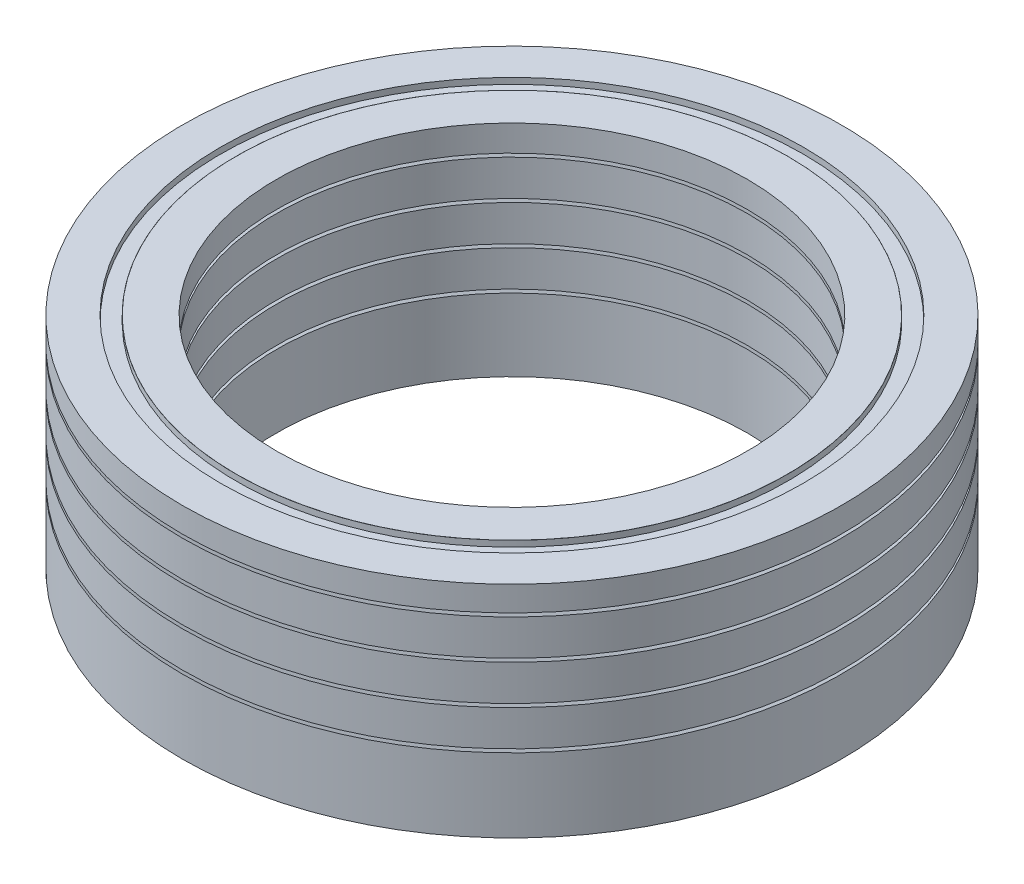
ISO-10303-21;
HEADER;
FILE_DESCRIPTION(('STEP AP214'),'2;1');
FILE_NAME('part.step','',(''),(''),'','','');
FILE_SCHEMA(('AUTOMOTIVE_DESIGN { 1 0 10303 214 1 1 1 1 }'));
ENDSEC;
DATA;
#1=APPLICATION_CONTEXT('core data for automotive mechanical design processes');
#2=APPLICATION_PROTOCOL_DEFINITION('international standard','automotive_design',2000,#1);
#3=PRODUCT_CONTEXT('',#1,'mechanical');
#4=PRODUCT('Part','Part','',(#3));
#5=PRODUCT_RELATED_PRODUCT_CATEGORY('part','',(#4));
#6=PRODUCT_DEFINITION_FORMATION('','',#4);
#7=PRODUCT_DEFINITION_CONTEXT('part definition',#1,'design');
#8=PRODUCT_DEFINITION('design','',#6,#7);
#9=PRODUCT_DEFINITION_SHAPE('','',#8);
#10=(LENGTH_UNIT() NAMED_UNIT(*) SI_UNIT(.MILLI.,.METRE.));
#11=(NAMED_UNIT(*) PLANE_ANGLE_UNIT() SI_UNIT($,.RADIAN.));
#12=(NAMED_UNIT(*) SI_UNIT($,.STERADIAN.) SOLID_ANGLE_UNIT());
#13=UNCERTAINTY_MEASURE_WITH_UNIT(LENGTH_MEASURE(1.E-05),#10,'distance_accuracy_value','');
#14=(GEOMETRIC_REPRESENTATION_CONTEXT(3) GLOBAL_UNCERTAINTY_ASSIGNED_CONTEXT((#13)) GLOBAL_UNIT_ASSIGNED_CONTEXT((#10,
#11,#12)) REPRESENTATION_CONTEXT('',''));
#15=CARTESIAN_POINT('',(0.,0.,0.));
#16=DIRECTION('',(0.,0.,1.));
#17=DIRECTION('',(1.,0.,0.));
#18=AXIS2_PLACEMENT_3D('',#15,#16,#17);
#19=CARTESIAN_POINT('',(0.,14.,0.));
#20=DIRECTION('',(0.,-1.,0.));
#21=DIRECTION('',(0.,0.,-1.));
#22=AXIS2_PLACEMENT_3D('',#19,#20,#21);
#23=CYLINDRICAL_SURFACE('',#22,21.);
#24=CARTESIAN_POINT('',(0.,0.,0.));
#25=DIRECTION('',(0.,1.,0.));
#26=DIRECTION('',(0.,0.,1.));
#27=AXIS2_PLACEMENT_3D('',#24,#25,#26);
#28=CIRCLE('',#27,21.);
#29=CARTESIAN_POINT('',(0.,0.,21.));
#30=VERTEX_POINT('',#29);
#31=EDGE_CURVE('E66',#30,#30,#28,.T.);
#32=ORIENTED_EDGE('',*,*,#31,.T.);
#33=EDGE_LOOP('',(#32));
#34=FACE_BOUND('',#33,.T.);
#35=CARTESIAN_POINT('',(0.,4.69528194298986,0.));
#36=DIRECTION('',(0.,1.,0.));
#37=DIRECTION('',(0.,0.,1.));
#38=AXIS2_PLACEMENT_3D('',#35,#36,#37);
#39=CIRCLE('',#38,21.);
#40=CARTESIAN_POINT('',(0.,4.69528194298986,21.));
#41=VERTEX_POINT('',#40);
#42=EDGE_CURVE('E51',#41,#41,#39,.T.);
#43=ORIENTED_EDGE('',*,*,#42,.F.);
#44=EDGE_LOOP('',(#43));
#45=FACE_BOUND('',#44,.T.);
#46=ADVANCED_FACE('F39',(#34,#45),#23,.T.);
#47=CARTESIAN_POINT('',(0.,14.,0.));
#48=DIRECTION('',(0.,-1.,0.));
#49=DIRECTION('',(0.,0.,-1.));
#50=AXIS2_PLACEMENT_3D('',#47,#48,#49);
#51=CYLINDRICAL_SURFACE('',#50,15.);
#52=CARTESIAN_POINT('',(0.,0.,0.));
#53=DIRECTION('',(0.,1.,0.));
#54=DIRECTION('',(0.,0.,1.));
#55=AXIS2_PLACEMENT_3D('',#52,#53,#54);
#56=CIRCLE('',#55,15.);
#57=CARTESIAN_POINT('',(0.,0.,15.));
#58=VERTEX_POINT('',#57);
#59=EDGE_CURVE('E54',#58,#58,#56,.T.);
#60=ORIENTED_EDGE('',*,*,#59,.F.);
#61=EDGE_LOOP('',(#60));
#62=FACE_BOUND('',#61,.T.);
#63=CARTESIAN_POINT('',(0.,4.61704368073582,0.));
#64=DIRECTION('',(0.,-1.,0.));
#65=DIRECTION('',(0.,0.,-1.));
#66=AXIS2_PLACEMENT_3D('',#63,#64,#65);
#67=CIRCLE('',#66,15.);
#68=CARTESIAN_POINT('',(0.,4.61704368073582,-15.));
#69=VERTEX_POINT('',#68);
#70=EDGE_CURVE('E62',#69,#69,#67,.F.);
#71=ORIENTED_EDGE('',*,*,#70,.T.);
#72=EDGE_LOOP('',(#71));
#73=FACE_BOUND('',#72,.T.);
#74=ADVANCED_FACE('F78',(#62,#73),#51,.F.);
#75=CARTESIAN_POINT('',(0.,0.,0.));
#76=DIRECTION('',(0.,1.,0.));
#77=DIRECTION('',(0.,0.,1.));
#78=AXIS2_PLACEMENT_3D('',#75,#76,#77);
#79=PLANE('',#78);
#80=ORIENTED_EDGE('',*,*,#31,.F.);
#81=EDGE_LOOP('',(#80));
#82=FACE_BOUND('',#81,.T.);
#83=ORIENTED_EDGE('',*,*,#59,.T.);
#84=EDGE_LOOP('',(#83));
#85=FACE_BOUND('',#84,.T.);
#86=ADVANCED_FACE('F83',(#82,#85),#79,.F.);
#87=CARTESIAN_POINT('',(0.,0.,0.));
#88=DIRECTION('',(0.,-1.,0.));
#89=DIRECTION('',(0.,0.,-1.));
#90=AXIS2_PLACEMENT_3D('',#87,#88,#89);
#91=CYLINDRICAL_SURFACE('',#90,18.5603987615445);
#92=CARTESIAN_POINT('',(0.,3.11396489088046,0.));
#93=DIRECTION('',(0.,-1.,0.));
#94=DIRECTION('',(0.,0.,-1.));
#95=AXIS2_PLACEMENT_3D('',#92,#93,#94);
#96=CIRCLE('',#95,18.5603987615445);
#97=CARTESIAN_POINT('',(0.,3.11396489088046,-18.5603987615445));
#98=VERTEX_POINT('',#97);
#99=EDGE_CURVE('E56',#98,#98,#96,.T.);
#100=ORIENTED_EDGE('',*,*,#99,.T.);
#101=EDGE_LOOP('',(#100));
#102=FACE_BOUND('',#101,.T.);
#103=CARTESIAN_POINT('',(0.,3.52070715703717,0.));
#104=DIRECTION('',(0.,-1.,0.));
#105=DIRECTION('',(0.,0.,-1.));
#106=AXIS2_PLACEMENT_3D('',#103,#104,#105);
#107=CIRCLE('',#106,18.5603987615445);
#108=CARTESIAN_POINT('',(0.,3.52070715703717,-18.5603987615445));
#109=VERTEX_POINT('',#108);
#110=EDGE_CURVE('E42',#109,#109,#107,.T.);
#111=ORIENTED_EDGE('',*,*,#110,.F.);
#112=EDGE_LOOP('',(#111));
#113=FACE_BOUND('',#112,.T.);
#114=ADVANCED_FACE('F88',(#102,#113),#91,.F.);
#115=CARTESIAN_POINT('',(0.,4.83961079064219,0.));
#116=DIRECTION('',(0.,1.,0.));
#117=DIRECTION('',(0.,0.,1.));
#118=AXIS2_PLACEMENT_3D('',#115,#116,#117);
#119=CONICAL_SURFACE('',#118,21.2997721726096,1.12208896626812);
#120=ORIENTED_EDGE('',*,*,#110,.T.);
#121=EDGE_LOOP('',(#120));
#122=FACE_BOUND('',#121,.T.);
#123=ORIENTED_EDGE('',*,*,#42,.T.);
#124=EDGE_LOOP('',(#123));
#125=FACE_BOUND('',#124,.T.);
#126=ADVANCED_FACE('F75',(#122,#125),#119,.F.);
#127=CARTESIAN_POINT('',(0.,3.11396489088046,18.5603987615445));
#128=DIRECTION('',(0.,1.,0.));
#129=DIRECTION('',(0.,0.,1.));
#130=AXIS2_PLACEMENT_3D('',#127,#128,#129);
#131=PLANE('',#130);
#132=CARTESIAN_POINT('',(0.,3.11396489088046,0.));
#133=DIRECTION('',(0.,-1.,0.));
#134=DIRECTION('',(0.,0.,-1.));
#135=AXIS2_PLACEMENT_3D('',#132,#133,#134);
#136=CIRCLE('',#135,17.5603987615445);
#137=CARTESIAN_POINT('',(0.,3.11396489088046,-17.5603987615445));
#138=VERTEX_POINT('',#137);
#139=EDGE_CURVE('E46',#138,#138,#136,.T.);
#140=ORIENTED_EDGE('',*,*,#139,.T.);
#141=EDGE_LOOP('',(#140));
#142=FACE_BOUND('',#141,.T.);
#143=ORIENTED_EDGE('',*,*,#99,.F.);
#144=EDGE_LOOP('',(#143));
#145=FACE_BOUND('',#144,.T.);
#146=ADVANCED_FACE('F102',(#142,#145),#131,.T.);
#147=CARTESIAN_POINT('',(0.,0.,0.));
#148=DIRECTION('',(0.,-1.,0.));
#149=DIRECTION('',(0.,0.,-1.));
#150=AXIS2_PLACEMENT_3D('',#147,#148,#149);
#151=CYLINDRICAL_SURFACE('',#150,17.5603987615445);
#152=CARTESIAN_POINT('',(0.,3.49842286258532,0.));
#153=DIRECTION('',(0.,-1.,0.));
#154=DIRECTION('',(0.,0.,-1.));
#155=AXIS2_PLACEMENT_3D('',#152,#153,#154);
#156=CIRCLE('',#155,17.5603987615445);
#157=CARTESIAN_POINT('',(0.,3.49842286258532,-17.5603987615445));
#158=VERTEX_POINT('',#157);
#159=EDGE_CURVE('E11',#158,#158,#156,.T.);
#160=ORIENTED_EDGE('',*,*,#159,.T.);
#161=EDGE_LOOP('',(#160));
#162=FACE_BOUND('',#161,.T.);
#163=ORIENTED_EDGE('',*,*,#139,.F.);
#164=EDGE_LOOP('',(#163));
#165=FACE_BOUND('',#164,.T.);
#166=ADVANCED_FACE('F98',(#162,#165),#151,.T.);
#167=CARTESIAN_POINT('',(0.,3.49842286258532,0.));
#168=DIRECTION('',(0.,-1.,0.));
#169=DIRECTION('',(0.,0.,-1.));
#170=AXIS2_PLACEMENT_3D('',#167,#168,#169);
#171=CONICAL_SURFACE('',#170,17.5603987615445,1.15889530950393);
#172=ORIENTED_EDGE('',*,*,#70,.F.);
#173=EDGE_LOOP('',(#172));
#174=FACE_BOUND('',#173,.T.);
#175=ORIENTED_EDGE('',*,*,#159,.F.);
#176=EDGE_LOOP('',(#175));
#177=FACE_BOUND('',#176,.T.);
#178=ADVANCED_FACE('F95',(#174,#177),#171,.T.);
#179=CLOSED_SHELL('',(#46,#74,#86,#114,#126,#146,#166,#178));
#180=MANIFOLD_SOLID_BREP('B2',#179);
#181=CARTESIAN_POINT('',(0.,14.,0.));
#182=DIRECTION('',(0.,-1.,0.));
#183=DIRECTION('',(0.,0.,-1.));
#184=AXIS2_PLACEMENT_3D('',#181,#182,#183);
#185=CYLINDRICAL_SURFACE('',#184,15.);
#186=CARTESIAN_POINT('',(0.,4.83529818095055,0.));
#187=DIRECTION('',(0.,-1.,0.));
#188=DIRECTION('',(0.,0.,-1.));
#189=AXIS2_PLACEMENT_3D('',#186,#187,#188);
#190=CIRCLE('',#189,15.);
#191=CARTESIAN_POINT('',(0.,4.83529818095055,-15.));
#192=VERTEX_POINT('',#191);
#193=EDGE_CURVE('E184',#192,#192,#190,.T.);
#194=ORIENTED_EDGE('',*,*,#193,.T.);
#195=EDGE_LOOP('',(#194));
#196=FACE_BOUND('',#195,.T.);
#197=CARTESIAN_POINT('',(0.,7.11704368073584,0.));
#198=DIRECTION('',(0.,-1.,0.));
#199=DIRECTION('',(0.,0.,-1.));
#200=AXIS2_PLACEMENT_3D('',#197,#198,#199);
#201=CIRCLE('',#200,15.);
#202=CARTESIAN_POINT('',(0.,7.11704368073584,-15.));
#203=VERTEX_POINT('',#202);
#204=EDGE_CURVE('E200',#203,#203,#201,.F.);
#205=ORIENTED_EDGE('',*,*,#204,.T.);
#206=EDGE_LOOP('',(#205));
#207=FACE_BOUND('',#206,.T.);
#208=ADVANCED_FACE('F168',(#196,#207),#185,.F.);
#209=CARTESIAN_POINT('',(0.,5.17758150863495,0.));
#210=DIRECTION('',(0.,-1.,0.));
#211=DIRECTION('',(0.,0.,-1.));
#212=AXIS2_PLACEMENT_3D('',#209,#210,#211);
#213=CONICAL_SURFACE('',#212,14.2165514944112,1.15889530950393);
#214=ORIENTED_EDGE('',*,*,#193,.F.);
#215=EDGE_LOOP('',(#214));
#216=FACE_BOUND('',#215,.T.);
#217=CARTESIAN_POINT('',(0.,3.5,0.));
#218=DIRECTION('',(0.,-1.,0.));
#219=DIRECTION('',(0.,0.,-1.));
#220=AXIS2_PLACEMENT_3D('',#217,#218,#219);
#221=CIRCLE('',#220,18.0563491697313);
#222=CARTESIAN_POINT('',(0.,3.5,-18.0563491697313));
#223=VERTEX_POINT('',#222);
#224=EDGE_CURVE('E172',#223,#223,#221,.T.);
#225=ORIENTED_EDGE('',*,*,#224,.T.);
#226=EDGE_LOOP('',(#225));
#227=FACE_BOUND('',#226,.T.);
#228=ADVANCED_FACE('F209',(#216,#227),#213,.F.);
#229=CARTESIAN_POINT('',(0.,3.5,0.));
#230=DIRECTION('',(0.,1.,0.));
#231=DIRECTION('',(0.,0.,1.));
#232=AXIS2_PLACEMENT_3D('',#229,#230,#231);
#233=CONICAL_SURFACE('',#232,18.0563491697313,1.12208896626812);
#234=ORIENTED_EDGE('',*,*,#224,.F.);
#235=EDGE_LOOP('',(#234));
#236=FACE_BOUND('',#235,.T.);
#237=CARTESIAN_POINT('',(0.,4.91725540608073,0.));
#238=DIRECTION('',(0.,1.,0.));
#239=DIRECTION('',(0.,0.,1.));
#240=AXIS2_PLACEMENT_3D('',#237,#238,#239);
#241=CIRCLE('',#240,21.);
#242=CARTESIAN_POINT('',(0.,4.91725540608073,21.));
#243=VERTEX_POINT('',#242);
#244=EDGE_CURVE('E190',#243,#243,#241,.F.);
#245=ORIENTED_EDGE('',*,*,#244,.T.);
#246=EDGE_LOOP('',(#245));
#247=FACE_BOUND('',#246,.T.);
#248=ADVANCED_FACE('F212',(#236,#247),#233,.T.);
#249=CARTESIAN_POINT('',(0.,0.,0.));
#250=DIRECTION('',(0.,-1.,0.));
#251=DIRECTION('',(0.,0.,-1.));
#252=AXIS2_PLACEMENT_3D('',#249,#250,#251);
#253=CYLINDRICAL_SURFACE('',#252,18.5603987615445);
#254=CARTESIAN_POINT('',(0.,5.61396489088047,0.));
#255=DIRECTION('',(0.,-1.,0.));
#256=DIRECTION('',(0.,0.,-1.));
#257=AXIS2_PLACEMENT_3D('',#254,#255,#256);
#258=CIRCLE('',#257,18.5603987615445);
#259=CARTESIAN_POINT('',(0.,5.61396489088047,-18.5603987615445));
#260=VERTEX_POINT('',#259);
#261=EDGE_CURVE('E187',#260,#260,#258,.T.);
#262=ORIENTED_EDGE('',*,*,#261,.T.);
#263=EDGE_LOOP('',(#262));
#264=FACE_BOUND('',#263,.T.);
#265=CARTESIAN_POINT('',(0.,6.02070715703719,0.));
#266=DIRECTION('',(0.,-1.,0.));
#267=DIRECTION('',(0.,0.,-1.));
#268=AXIS2_PLACEMENT_3D('',#265,#266,#267);
#269=CIRCLE('',#268,18.5603987615445);
#270=CARTESIAN_POINT('',(0.,6.02070715703719,-18.5603987615445));
#271=VERTEX_POINT('',#270);
#272=EDGE_CURVE('E189',#271,#271,#269,.T.);
#273=ORIENTED_EDGE('',*,*,#272,.F.);
#274=EDGE_LOOP('',(#273));
#275=FACE_BOUND('',#274,.T.);
#276=ADVANCED_FACE('F218',(#264,#275),#253,.F.);
#277=CARTESIAN_POINT('',(0.,7.33961079064219,0.));
#278=DIRECTION('',(0.,1.,0.));
#279=DIRECTION('',(0.,0.,1.));
#280=AXIS2_PLACEMENT_3D('',#277,#278,#279);
#281=CONICAL_SURFACE('',#280,21.2997721726096,1.12208896626812);
#282=ORIENTED_EDGE('',*,*,#272,.T.);
#283=EDGE_LOOP('',(#282));
#284=FACE_BOUND('',#283,.T.);
#285=CARTESIAN_POINT('',(0.,7.19528194298986,0.));
#286=DIRECTION('',(0.,1.,0.));
#287=DIRECTION('',(0.,0.,1.));
#288=AXIS2_PLACEMENT_3D('',#285,#286,#287);
#289=CIRCLE('',#288,21.);
#290=CARTESIAN_POINT('',(0.,7.19528194298986,21.));
#291=VERTEX_POINT('',#290);
#292=EDGE_CURVE('E181',#291,#291,#289,.T.);
#293=ORIENTED_EDGE('',*,*,#292,.T.);
#294=EDGE_LOOP('',(#293));
#295=FACE_BOUND('',#294,.T.);
#296=ADVANCED_FACE('F235',(#284,#295),#281,.F.);
#297=CARTESIAN_POINT('',(0.,5.61396489088047,18.5603987615445));
#298=DIRECTION('',(0.,1.,0.));
#299=DIRECTION('',(0.,0.,1.));
#300=AXIS2_PLACEMENT_3D('',#297,#298,#299);
#301=PLANE('',#300);
#302=CARTESIAN_POINT('',(0.,5.61396489088047,0.));
#303=DIRECTION('',(0.,-1.,0.));
#304=DIRECTION('',(0.,0.,-1.));
#305=AXIS2_PLACEMENT_3D('',#302,#303,#304);
#306=CIRCLE('',#305,17.5603987615445);
#307=CARTESIAN_POINT('',(0.,5.61396489088047,-17.5603987615445));
#308=VERTEX_POINT('',#307);
#309=EDGE_CURVE('E176',#308,#308,#306,.T.);
#310=ORIENTED_EDGE('',*,*,#309,.T.);
#311=EDGE_LOOP('',(#310));
#312=FACE_BOUND('',#311,.T.);
#313=ORIENTED_EDGE('',*,*,#261,.F.);
#314=EDGE_LOOP('',(#313));
#315=FACE_BOUND('',#314,.T.);
#316=ADVANCED_FACE('F238',(#312,#315),#301,.T.);
#317=CARTESIAN_POINT('',(0.,0.,0.));
#318=DIRECTION('',(0.,-1.,0.));
#319=DIRECTION('',(0.,0.,-1.));
#320=AXIS2_PLACEMENT_3D('',#317,#318,#319);
#321=CYLINDRICAL_SURFACE('',#320,17.5603987615445);
#322=CARTESIAN_POINT('',(0.,5.99842286258533,0.));
#323=DIRECTION('',(0.,-1.,0.));
#324=DIRECTION('',(0.,0.,-1.));
#325=AXIS2_PLACEMENT_3D('',#322,#323,#324);
#326=CIRCLE('',#325,17.5603987615445);
#327=CARTESIAN_POINT('',(0.,5.99842286258533,-17.5603987615445));
#328=VERTEX_POINT('',#327);
#329=EDGE_CURVE('E38',#328,#328,#326,.T.);
#330=ORIENTED_EDGE('',*,*,#329,.T.);
#331=EDGE_LOOP('',(#330));
#332=FACE_BOUND('',#331,.T.);
#333=ORIENTED_EDGE('',*,*,#309,.F.);
#334=EDGE_LOOP('',(#333));
#335=FACE_BOUND('',#334,.T.);
#336=ADVANCED_FACE('F228',(#332,#335),#321,.T.);
#337=CARTESIAN_POINT('',(0.,5.99842286258533,0.));
#338=DIRECTION('',(0.,-1.,0.));
#339=DIRECTION('',(0.,0.,-1.));
#340=AXIS2_PLACEMENT_3D('',#337,#338,#339);
#341=CONICAL_SURFACE('',#340,17.5603987615445,1.15889530950393);
#342=ORIENTED_EDGE('',*,*,#204,.F.);
#343=EDGE_LOOP('',(#342));
#344=FACE_BOUND('',#343,.T.);
#345=ORIENTED_EDGE('',*,*,#329,.F.);
#346=EDGE_LOOP('',(#345));
#347=FACE_BOUND('',#346,.T.);
#348=ADVANCED_FACE('F224',(#344,#347),#341,.T.);
#349=CARTESIAN_POINT('',(0.,14.,0.));
#350=DIRECTION('',(0.,-1.,0.));
#351=DIRECTION('',(0.,0.,-1.));
#352=AXIS2_PLACEMENT_3D('',#349,#350,#351);
#353=CYLINDRICAL_SURFACE('',#352,21.);
#354=ORIENTED_EDGE('',*,*,#244,.F.);
#355=EDGE_LOOP('',(#354));
#356=FACE_BOUND('',#355,.T.);
#357=ORIENTED_EDGE('',*,*,#292,.F.);
#358=EDGE_LOOP('',(#357));
#359=FACE_BOUND('',#358,.T.);
#360=ADVANCED_FACE('F170',(#356,#359),#353,.T.);
#361=CLOSED_SHELL('',(#208,#228,#248,#276,#296,#316,#336,#348,#360));
#362=MANIFOLD_SOLID_BREP('B6',#361);
#363=CARTESIAN_POINT('',(0.,14.,0.));
#364=DIRECTION('',(0.,-1.,0.));
#365=DIRECTION('',(0.,0.,-1.));
#366=AXIS2_PLACEMENT_3D('',#363,#364,#365);
#367=CYLINDRICAL_SURFACE('',#366,15.);
#368=CARTESIAN_POINT('',(0.,7.33529818095057,0.));
#369=DIRECTION('',(0.,-1.,0.));
#370=DIRECTION('',(0.,0.,-1.));
#371=AXIS2_PLACEMENT_3D('',#368,#369,#370);
#372=CIRCLE('',#371,15.);
#373=CARTESIAN_POINT('',(0.,7.33529818095057,-15.));
#374=VERTEX_POINT('',#373);
#375=EDGE_CURVE('E328',#374,#374,#372,.T.);
#376=ORIENTED_EDGE('',*,*,#375,.T.);
#377=EDGE_LOOP('',(#376));
#378=FACE_BOUND('',#377,.T.);
#379=CARTESIAN_POINT('',(0.,9.61704368073585,0.));
#380=DIRECTION('',(0.,-1.,0.));
#381=DIRECTION('',(0.,0.,-1.));
#382=AXIS2_PLACEMENT_3D('',#379,#380,#381);
#383=CIRCLE('',#382,15.);
#384=CARTESIAN_POINT('',(0.,9.61704368073585,-15.));
#385=VERTEX_POINT('',#384);
#386=EDGE_CURVE('E344',#385,#385,#383,.F.);
#387=ORIENTED_EDGE('',*,*,#386,.T.);
#388=EDGE_LOOP('',(#387));
#389=FACE_BOUND('',#388,.T.);
#390=ADVANCED_FACE('F312',(#378,#389),#367,.F.);
#391=CARTESIAN_POINT('',(0.,7.67758150863497,0.));
#392=DIRECTION('',(0.,-1.,0.));
#393=DIRECTION('',(0.,0.,-1.));
#394=AXIS2_PLACEMENT_3D('',#391,#392,#393);
#395=CONICAL_SURFACE('',#394,14.2165514944113,1.15889530950393);
#396=ORIENTED_EDGE('',*,*,#375,.F.);
#397=EDGE_LOOP('',(#396));
#398=FACE_BOUND('',#397,.T.);
#399=CARTESIAN_POINT('',(0.,6.00000000000001,0.));
#400=DIRECTION('',(0.,-1.,0.));
#401=DIRECTION('',(0.,0.,-1.));
#402=AXIS2_PLACEMENT_3D('',#399,#400,#401);
#403=CIRCLE('',#402,18.0563491697313);
#404=CARTESIAN_POINT('',(0.,6.00000000000001,-18.0563491697313));
#405=VERTEX_POINT('',#404);
#406=EDGE_CURVE('E316',#405,#405,#403,.T.);
#407=ORIENTED_EDGE('',*,*,#406,.T.);
#408=EDGE_LOOP('',(#407));
#409=FACE_BOUND('',#408,.T.);
#410=ADVANCED_FACE('F353',(#398,#409),#395,.F.);
#411=CARTESIAN_POINT('',(0.,6.00000000000001,0.));
#412=DIRECTION('',(0.,1.,0.));
#413=DIRECTION('',(0.,0.,1.));
#414=AXIS2_PLACEMENT_3D('',#411,#412,#413);
#415=CONICAL_SURFACE('',#414,18.0563491697313,1.12208896626812);
#416=ORIENTED_EDGE('',*,*,#406,.F.);
#417=EDGE_LOOP('',(#416));
#418=FACE_BOUND('',#417,.T.);
#419=CARTESIAN_POINT('',(0.,7.41725540608074,0.));
#420=DIRECTION('',(0.,1.,0.));
#421=DIRECTION('',(0.,0.,1.));
#422=AXIS2_PLACEMENT_3D('',#419,#420,#421);
#423=CIRCLE('',#422,21.);
#424=CARTESIAN_POINT('',(0.,7.41725540608074,21.));
#425=VERTEX_POINT('',#424);
#426=EDGE_CURVE('E334',#425,#425,#423,.F.);
#427=ORIENTED_EDGE('',*,*,#426,.T.);
#428=EDGE_LOOP('',(#427));
#429=FACE_BOUND('',#428,.T.);
#430=ADVANCED_FACE('F356',(#418,#429),#415,.T.);
#431=CARTESIAN_POINT('',(0.,0.,0.));
#432=DIRECTION('',(0.,-1.,0.));
#433=DIRECTION('',(0.,0.,-1.));
#434=AXIS2_PLACEMENT_3D('',#431,#432,#433);
#435=CYLINDRICAL_SURFACE('',#434,18.5603987615445);
#436=CARTESIAN_POINT('',(0.,8.11396489088047,0.));
#437=DIRECTION('',(0.,-1.,0.));
#438=DIRECTION('',(0.,0.,-1.));
#439=AXIS2_PLACEMENT_3D('',#436,#437,#438);
#440=CIRCLE('',#439,18.5603987615445);
#441=CARTESIAN_POINT('',(0.,8.11396489088047,-18.5603987615445));
#442=VERTEX_POINT('',#441);
#443=EDGE_CURVE('E331',#442,#442,#440,.T.);
#444=ORIENTED_EDGE('',*,*,#443,.T.);
#445=EDGE_LOOP('',(#444));
#446=FACE_BOUND('',#445,.T.);
#447=CARTESIAN_POINT('',(0.,8.52070715703719,0.));
#448=DIRECTION('',(0.,-1.,0.));
#449=DIRECTION('',(0.,0.,-1.));
#450=AXIS2_PLACEMENT_3D('',#447,#448,#449);
#451=CIRCLE('',#450,18.5603987615445);
#452=CARTESIAN_POINT('',(0.,8.52070715703719,-18.5603987615445));
#453=VERTEX_POINT('',#452);
#454=EDGE_CURVE('E333',#453,#453,#451,.T.);
#455=ORIENTED_EDGE('',*,*,#454,.F.);
#456=EDGE_LOOP('',(#455));
#457=FACE_BOUND('',#456,.T.);
#458=ADVANCED_FACE('F362',(#446,#457),#435,.F.);
#459=CARTESIAN_POINT('',(0.,9.83961079064218,0.));
#460=DIRECTION('',(0.,1.,0.));
#461=DIRECTION('',(0.,0.,1.));
#462=AXIS2_PLACEMENT_3D('',#459,#460,#461);
#463=CONICAL_SURFACE('',#462,21.2997721726096,1.12208896626812);
#464=ORIENTED_EDGE('',*,*,#454,.T.);
#465=EDGE_LOOP('',(#464));
#466=FACE_BOUND('',#465,.T.);
#467=CARTESIAN_POINT('',(0.,9.69528194298985,0.));
#468=DIRECTION('',(0.,1.,0.));
#469=DIRECTION('',(0.,0.,1.));
#470=AXIS2_PLACEMENT_3D('',#467,#468,#469);
#471=CIRCLE('',#470,21.);
#472=CARTESIAN_POINT('',(0.,9.69528194298985,21.));
#473=VERTEX_POINT('',#472);
#474=EDGE_CURVE('E325',#473,#473,#471,.T.);
#475=ORIENTED_EDGE('',*,*,#474,.T.);
#476=EDGE_LOOP('',(#475));
#477=FACE_BOUND('',#476,.T.);
#478=ADVANCED_FACE('F379',(#466,#477),#463,.F.);
#479=CARTESIAN_POINT('',(0.,8.11396489088046,18.5603987615445));
#480=DIRECTION('',(0.,1.,0.));
#481=DIRECTION('',(0.,0.,1.));
#482=AXIS2_PLACEMENT_3D('',#479,#480,#481);
#483=PLANE('',#482);
#484=CARTESIAN_POINT('',(0.,8.11396489088047,0.));
#485=DIRECTION('',(0.,-1.,0.));
#486=DIRECTION('',(0.,0.,-1.));
#487=AXIS2_PLACEMENT_3D('',#484,#485,#486);
#488=CIRCLE('',#487,17.5603987615445);
#489=CARTESIAN_POINT('',(0.,8.11396489088047,-17.5603987615445));
#490=VERTEX_POINT('',#489);
#491=EDGE_CURVE('E320',#490,#490,#488,.T.);
#492=ORIENTED_EDGE('',*,*,#491,.T.);
#493=EDGE_LOOP('',(#492));
#494=FACE_BOUND('',#493,.T.);
#495=ORIENTED_EDGE('',*,*,#443,.F.);
#496=EDGE_LOOP('',(#495));
#497=FACE_BOUND('',#496,.T.);
#498=ADVANCED_FACE('F382',(#494,#497),#483,.T.);
#499=CARTESIAN_POINT('',(0.,0.,0.));
#500=DIRECTION('',(0.,-1.,0.));
#501=DIRECTION('',(0.,0.,-1.));
#502=AXIS2_PLACEMENT_3D('',#499,#500,#501);
#503=CYLINDRICAL_SURFACE('',#502,17.5603987615445);
#504=CARTESIAN_POINT('',(0.,8.49842286258533,0.));
#505=DIRECTION('',(0.,-1.,0.));
#506=DIRECTION('',(0.,0.,-1.));
#507=AXIS2_PLACEMENT_3D('',#504,#505,#506);
#508=CIRCLE('',#507,17.5603987615445);
#509=CARTESIAN_POINT('',(0.,8.49842286258533,-17.5603987615445));
#510=VERTEX_POINT('',#509);
#511=EDGE_CURVE('E167',#510,#510,#508,.T.);
#512=ORIENTED_EDGE('',*,*,#511,.T.);
#513=EDGE_LOOP('',(#512));
#514=FACE_BOUND('',#513,.T.);
#515=ORIENTED_EDGE('',*,*,#491,.F.);
#516=EDGE_LOOP('',(#515));
#517=FACE_BOUND('',#516,.T.);
#518=ADVANCED_FACE('F372',(#514,#517),#503,.T.);
#519=CARTESIAN_POINT('',(0.,8.49842286258533,0.));
#520=DIRECTION('',(0.,-1.,0.));
#521=DIRECTION('',(0.,0.,-1.));
#522=AXIS2_PLACEMENT_3D('',#519,#520,#521);
#523=CONICAL_SURFACE('',#522,17.5603987615445,1.15889530950393);
#524=ORIENTED_EDGE('',*,*,#386,.F.);
#525=EDGE_LOOP('',(#524));
#526=FACE_BOUND('',#525,.T.);
#527=ORIENTED_EDGE('',*,*,#511,.F.);
#528=EDGE_LOOP('',(#527));
#529=FACE_BOUND('',#528,.T.);
#530=ADVANCED_FACE('F368',(#526,#529),#523,.T.);
#531=CARTESIAN_POINT('',(0.,14.,0.));
#532=DIRECTION('',(0.,-1.,0.));
#533=DIRECTION('',(0.,0.,-1.));
#534=AXIS2_PLACEMENT_3D('',#531,#532,#533);
#535=CYLINDRICAL_SURFACE('',#534,21.);
#536=ORIENTED_EDGE('',*,*,#426,.F.);
#537=EDGE_LOOP('',(#536));
#538=FACE_BOUND('',#537,.T.);
#539=ORIENTED_EDGE('',*,*,#474,.F.);
#540=EDGE_LOOP('',(#539));
#541=FACE_BOUND('',#540,.T.);
#542=ADVANCED_FACE('F314',(#538,#541),#535,.T.);
#543=CLOSED_SHELL('',(#390,#410,#430,#458,#478,#498,#518,#530,#542));
#544=MANIFOLD_SOLID_BREP('B33',#543);
#545=CARTESIAN_POINT('',(0.,14.,0.));
#546=DIRECTION('',(0.,-1.,0.));
#547=DIRECTION('',(0.,0.,-1.));
#548=AXIS2_PLACEMENT_3D('',#545,#546,#547);
#549=CYLINDRICAL_SURFACE('',#548,15.);
#550=CARTESIAN_POINT('',(0.,14.,0.));
#551=DIRECTION('',(0.,1.,0.));
#552=DIRECTION('',(0.,0.,1.));
#553=AXIS2_PLACEMENT_3D('',#550,#551,#552);
#554=CIRCLE('',#553,15.);
#555=CARTESIAN_POINT('',(0.,14.,15.));
#556=VERTEX_POINT('',#555);
#557=EDGE_CURVE('E463',#556,#556,#554,.T.);
#558=ORIENTED_EDGE('',*,*,#557,.T.);
#559=EDGE_LOOP('',(#558));
#560=FACE_BOUND('',#559,.T.);
#561=CARTESIAN_POINT('',(0.,12.3352981809506,0.));
#562=DIRECTION('',(0.,-1.,0.));
#563=DIRECTION('',(0.,0.,-1.));
#564=AXIS2_PLACEMENT_3D('',#561,#562,#563);
#565=CIRCLE('',#564,15.);
#566=CARTESIAN_POINT('',(0.,12.3352981809506,-15.));
#567=VERTEX_POINT('',#566);
#568=EDGE_CURVE('E471',#567,#567,#565,.T.);
#569=ORIENTED_EDGE('',*,*,#568,.T.);
#570=EDGE_LOOP('',(#569));
#571=FACE_BOUND('',#570,.T.);
#572=ADVANCED_FACE('F455',(#560,#571),#549,.F.);
#573=CARTESIAN_POINT('',(0.,14.,0.));
#574=DIRECTION('',(0.,1.,0.));
#575=DIRECTION('',(0.,0.,1.));
#576=AXIS2_PLACEMENT_3D('',#573,#574,#575);
#577=PLANE('',#576);
#578=ORIENTED_EDGE('',*,*,#557,.F.);
#579=EDGE_LOOP('',(#578));
#580=FACE_BOUND('',#579,.T.);
#581=CARTESIAN_POINT('',(0.,14.,0.));
#582=DIRECTION('',(0.,1.,0.));
#583=DIRECTION('',(0.,0.,1.));
#584=AXIS2_PLACEMENT_3D('',#581,#582,#583);
#585=CIRCLE('',#584,17.5567888692398);
#586=CARTESIAN_POINT('',(0.,14.,17.5567888692399));
#587=VERTEX_POINT('',#586);
#588=EDGE_CURVE('E459',#587,#587,#585,.T.);
#589=ORIENTED_EDGE('',*,*,#588,.T.);
#590=EDGE_LOOP('',(#589));
#591=FACE_BOUND('',#590,.T.);
#592=ADVANCED_FACE('F484',(#580,#591),#577,.T.);
#593=CARTESIAN_POINT('',(0.,12.677581508635,0.));
#594=DIRECTION('',(0.,-1.,0.));
#595=DIRECTION('',(0.,0.,-1.));
#596=AXIS2_PLACEMENT_3D('',#593,#594,#595);
#597=CONICAL_SURFACE('',#596,14.2165514944113,1.15889530950393);
#598=ORIENTED_EDGE('',*,*,#568,.F.);
#599=EDGE_LOOP('',(#598));
#600=FACE_BOUND('',#599,.T.);
#601=CARTESIAN_POINT('',(0.,11.,0.));
#602=DIRECTION('',(0.,-1.,0.));
#603=DIRECTION('',(0.,0.,-1.));
#604=AXIS2_PLACEMENT_3D('',#601,#602,#603);
#605=CIRCLE('',#604,18.0563491697313);
#606=CARTESIAN_POINT('',(0.,11.,-18.0563491697313));
#607=VERTEX_POINT('',#606);
#608=EDGE_CURVE('E502',#607,#607,#605,.T.);
#609=ORIENTED_EDGE('',*,*,#608,.T.);
#610=EDGE_LOOP('',(#609));
#611=FACE_BOUND('',#610,.T.);
#612=ADVANCED_FACE('F506',(#600,#611),#597,.F.);
#613=CARTESIAN_POINT('',(0.,11.,0.));
#614=DIRECTION('',(0.,1.,0.));
#615=DIRECTION('',(0.,0.,1.));
#616=AXIS2_PLACEMENT_3D('',#613,#614,#615);
#617=CONICAL_SURFACE('',#616,18.0563491697313,1.12208896626812);
#618=ORIENTED_EDGE('',*,*,#608,.F.);
#619=EDGE_LOOP('',(#618));
#620=FACE_BOUND('',#619,.T.);
#621=CARTESIAN_POINT('',(0.,12.4172554060807,0.));
#622=DIRECTION('',(0.,1.,0.));
#623=DIRECTION('',(0.,0.,1.));
#624=AXIS2_PLACEMENT_3D('',#621,#622,#623);
#625=CIRCLE('',#624,21.);
#626=CARTESIAN_POINT('',(0.,12.4172554060807,21.));
#627=VERTEX_POINT('',#626);
#628=EDGE_CURVE('E474',#627,#627,#625,.F.);
#629=ORIENTED_EDGE('',*,*,#628,.T.);
#630=EDGE_LOOP('',(#629));
#631=FACE_BOUND('',#630,.T.);
#632=ADVANCED_FACE('F508',(#620,#631),#617,.T.);
#633=CARTESIAN_POINT('',(0.,14.,0.));
#634=DIRECTION('',(0.,-1.,0.));
#635=DIRECTION('',(0.,0.,-1.));
#636=AXIS2_PLACEMENT_3D('',#633,#634,#635);
#637=CYLINDRICAL_SURFACE('',#636,21.);
#638=CARTESIAN_POINT('',(0.,14.,0.));
#639=DIRECTION('',(0.,1.,0.));
#640=DIRECTION('',(0.,0.,1.));
#641=AXIS2_PLACEMENT_3D('',#638,#639,#640);
#642=CIRCLE('',#641,21.);
#643=CARTESIAN_POINT('',(0.,14.,21.));
#644=VERTEX_POINT('',#643);
#645=EDGE_CURVE('E311',#644,#644,#642,.T.);
#646=ORIENTED_EDGE('',*,*,#645,.F.);
#647=EDGE_LOOP('',(#646));
#648=FACE_BOUND('',#647,.T.);
#649=ORIENTED_EDGE('',*,*,#628,.F.);
#650=EDGE_LOOP('',(#649));
#651=FACE_BOUND('',#650,.T.);
#652=ADVANCED_FACE('F457',(#648,#651),#637,.T.);
#653=ORIENTED_EDGE('',*,*,#645,.T.);
#654=EDGE_LOOP('',(#653));
#655=FACE_BOUND('',#654,.T.);
#656=CARTESIAN_POINT('',(0.,14.,0.));
#657=DIRECTION('',(0.,1.,0.));
#658=DIRECTION('',(0.,0.,1.));
#659=AXIS2_PLACEMENT_3D('',#656,#657,#658);
#660=CIRCLE('',#659,18.5603987615446);
#661=CARTESIAN_POINT('',(0.,14.,18.5603987615446));
#662=VERTEX_POINT('',#661);
#663=EDGE_CURVE('E477',#662,#662,#660,.F.);
#664=ORIENTED_EDGE('',*,*,#663,.T.);
#665=EDGE_LOOP('',(#664));
#666=FACE_BOUND('',#665,.T.);
#667=ADVANCED_FACE('F490',(#655,#666),#577,.T.);
#668=CARTESIAN_POINT('',(0.,13.9984228625853,0.));
#669=DIRECTION('',(0.,-1.,0.));
#670=DIRECTION('',(0.,0.,-1.));
#671=AXIS2_PLACEMENT_3D('',#668,#669,#670);
#672=CONICAL_SURFACE('',#671,17.5603987615446,1.15889530950393);
#673=ORIENTED_EDGE('',*,*,#588,.F.);
#674=EDGE_LOOP('',(#673));
#675=FACE_BOUND('',#674,.T.);
#676=CARTESIAN_POINT('',(0.,13.9984228625853,0.));
#677=DIRECTION('',(0.,-1.,0.));
#678=DIRECTION('',(0.,0.,-1.));
#679=AXIS2_PLACEMENT_3D('',#676,#677,#678);
#680=CIRCLE('',#679,17.5603987615446);
#681=CARTESIAN_POINT('',(0.,13.9984228625853,-17.5603987615446));
#682=VERTEX_POINT('',#681);
#683=EDGE_CURVE('E475',#682,#682,#680,.T.);
#684=ORIENTED_EDGE('',*,*,#683,.F.);
#685=EDGE_LOOP('',(#684));
#686=FACE_BOUND('',#685,.T.);
#687=ADVANCED_FACE('F486',(#675,#686),#672,.T.);
#688=CARTESIAN_POINT('',(0.,0.,0.));
#689=DIRECTION('',(0.,-1.,0.));
#690=DIRECTION('',(0.,0.,-1.));
#691=AXIS2_PLACEMENT_3D('',#688,#689,#690);
#692=CYLINDRICAL_SURFACE('',#691,17.5603987615446);
#693=ORIENTED_EDGE('',*,*,#683,.T.);
#694=EDGE_LOOP('',(#693));
#695=FACE_BOUND('',#694,.T.);
#696=CARTESIAN_POINT('',(0.,13.6139648908805,0.));
#697=DIRECTION('',(0.,-1.,0.));
#698=DIRECTION('',(0.,0.,-1.));
#699=AXIS2_PLACEMENT_3D('',#696,#697,#698);
#700=CIRCLE('',#699,17.5603987615446);
#701=CARTESIAN_POINT('',(0.,13.6139648908805,-17.5603987615446));
#702=VERTEX_POINT('',#701);
#703=EDGE_CURVE('E495',#702,#702,#700,.T.);
#704=ORIENTED_EDGE('',*,*,#703,.F.);
#705=EDGE_LOOP('',(#704));
#706=FACE_BOUND('',#705,.T.);
#707=ADVANCED_FACE('F489',(#695,#706),#692,.T.);
#708=CARTESIAN_POINT('',(0.,13.6139648908805,18.5603987615446));
#709=DIRECTION('',(0.,1.,0.));
#710=DIRECTION('',(0.,0.,1.));
#711=AXIS2_PLACEMENT_3D('',#708,#709,#710);
#712=PLANE('',#711);
#713=ORIENTED_EDGE('',*,*,#703,.T.);
#714=EDGE_LOOP('',(#713));
#715=FACE_BOUND('',#714,.T.);
#716=CARTESIAN_POINT('',(0.,13.6139648908805,0.));
#717=DIRECTION('',(0.,-1.,0.));
#718=DIRECTION('',(0.,0.,-1.));
#719=AXIS2_PLACEMENT_3D('',#716,#717,#718);
#720=CIRCLE('',#719,18.5603987615446);
#721=CARTESIAN_POINT('',(0.,13.6139648908805,-18.5603987615446));
#722=VERTEX_POINT('',#721);
#723=EDGE_CURVE('E497',#722,#722,#720,.T.);
#724=ORIENTED_EDGE('',*,*,#723,.F.);
#725=EDGE_LOOP('',(#724));
#726=FACE_BOUND('',#725,.T.);
#727=ADVANCED_FACE('F533',(#715,#726),#712,.T.);
#728=CARTESIAN_POINT('',(0.,0.,0.));
#729=DIRECTION('',(0.,-1.,0.));
#730=DIRECTION('',(0.,0.,-1.));
#731=AXIS2_PLACEMENT_3D('',#728,#729,#730);
#732=CYLINDRICAL_SURFACE('',#731,18.5603987615446);
#733=ORIENTED_EDGE('',*,*,#663,.F.);
#734=EDGE_LOOP('',(#733));
#735=FACE_BOUND('',#734,.T.);
#736=ORIENTED_EDGE('',*,*,#723,.T.);
#737=EDGE_LOOP('',(#736));
#738=FACE_BOUND('',#737,.T.);
#739=ADVANCED_FACE('F536',(#735,#738),#732,.F.);
#740=CLOSED_SHELL('',(#572,#592,#612,#632,#652,#667,#687,#707,#727,#739));
#741=MANIFOLD_SOLID_BREP('B162',#740);
#742=CARTESIAN_POINT('',(0.,14.,0.));
#743=DIRECTION('',(0.,-1.,0.));
#744=DIRECTION('',(0.,0.,-1.));
#745=AXIS2_PLACEMENT_3D('',#742,#743,#744);
#746=CYLINDRICAL_SURFACE('',#745,15.);
#747=CARTESIAN_POINT('',(0.,9.83529818095058,0.));
#748=DIRECTION('',(0.,-1.,0.));
#749=DIRECTION('',(0.,0.,-1.));
#750=AXIS2_PLACEMENT_3D('',#747,#748,#749);
#751=CIRCLE('',#750,15.);
#752=CARTESIAN_POINT('',(0.,9.83529818095058,-15.));
#753=VERTEX_POINT('',#752);
#754=EDGE_CURVE('E621',#753,#753,#751,.T.);
#755=ORIENTED_EDGE('',*,*,#754,.T.);
#756=EDGE_LOOP('',(#755));
#757=FACE_BOUND('',#756,.T.);
#758=CARTESIAN_POINT('',(0.,12.1170436807359,0.));
#759=DIRECTION('',(0.,-1.,0.));
#760=DIRECTION('',(0.,0.,-1.));
#761=AXIS2_PLACEMENT_3D('',#758,#759,#760);
#762=CIRCLE('',#761,15.);
#763=CARTESIAN_POINT('',(0.,12.1170436807359,-15.));
#764=VERTEX_POINT('',#763);
#765=EDGE_CURVE('E637',#764,#764,#762,.F.);
#766=ORIENTED_EDGE('',*,*,#765,.T.);
#767=EDGE_LOOP('',(#766));
#768=FACE_BOUND('',#767,.T.);
#769=ADVANCED_FACE('F605',(#757,#768),#746,.F.);
#770=CARTESIAN_POINT('',(0.,10.177581508635,0.));
#771=DIRECTION('',(0.,-1.,0.));
#772=DIRECTION('',(0.,0.,-1.));
#773=AXIS2_PLACEMENT_3D('',#770,#771,#772);
#774=CONICAL_SURFACE('',#773,14.2165514944113,1.15889530950393);
#775=ORIENTED_EDGE('',*,*,#754,.F.);
#776=EDGE_LOOP('',(#775));
#777=FACE_BOUND('',#776,.T.);
#778=CARTESIAN_POINT('',(0.,8.50000000000001,0.));
#779=DIRECTION('',(0.,-1.,0.));
#780=DIRECTION('',(0.,0.,-1.));
#781=AXIS2_PLACEMENT_3D('',#778,#779,#780);
#782=CIRCLE('',#781,18.0563491697313);
#783=CARTESIAN_POINT('',(0.,8.50000000000001,-18.0563491697313));
#784=VERTEX_POINT('',#783);
#785=EDGE_CURVE('E609',#784,#784,#782,.T.);
#786=ORIENTED_EDGE('',*,*,#785,.T.);
#787=EDGE_LOOP('',(#786));
#788=FACE_BOUND('',#787,.T.);
#789=ADVANCED_FACE('F646',(#777,#788),#774,.F.);
#790=CARTESIAN_POINT('',(0.,8.50000000000001,0.));
#791=DIRECTION('',(0.,1.,0.));
#792=DIRECTION('',(0.,0.,1.));
#793=AXIS2_PLACEMENT_3D('',#790,#791,#792);
#794=CONICAL_SURFACE('',#793,18.0563491697313,1.12208896626812);
#795=ORIENTED_EDGE('',*,*,#785,.F.);
#796=EDGE_LOOP('',(#795));
#797=FACE_BOUND('',#796,.T.);
#798=CARTESIAN_POINT('',(0.,9.91725540608072,0.));
#799=DIRECTION('',(0.,1.,0.));
#800=DIRECTION('',(0.,0.,1.));
#801=AXIS2_PLACEMENT_3D('',#798,#799,#800);
#802=CIRCLE('',#801,21.);
#803=CARTESIAN_POINT('',(0.,9.91725540608072,21.));
#804=VERTEX_POINT('',#803);
#805=EDGE_CURVE('E627',#804,#804,#802,.F.);
#806=ORIENTED_EDGE('',*,*,#805,.T.);
#807=EDGE_LOOP('',(#806));
#808=FACE_BOUND('',#807,.T.);
#809=ADVANCED_FACE('F649',(#797,#808),#794,.T.);
#810=CARTESIAN_POINT('',(0.,0.,0.));
#811=DIRECTION('',(0.,-1.,0.));
#812=DIRECTION('',(0.,0.,-1.));
#813=AXIS2_PLACEMENT_3D('',#810,#811,#812);
#814=CYLINDRICAL_SURFACE('',#813,18.5603987615445);
#815=CARTESIAN_POINT('',(0.,10.6139648908805,0.));
#816=DIRECTION('',(0.,-1.,0.));
#817=DIRECTION('',(0.,0.,-1.));
#818=AXIS2_PLACEMENT_3D('',#815,#816,#817);
#819=CIRCLE('',#818,18.5603987615445);
#820=CARTESIAN_POINT('',(0.,10.6139648908805,-18.5603987615446));
#821=VERTEX_POINT('',#820);
#822=EDGE_CURVE('E624',#821,#821,#819,.T.);
#823=ORIENTED_EDGE('',*,*,#822,.T.);
#824=EDGE_LOOP('',(#823));
#825=FACE_BOUND('',#824,.T.);
#826=CARTESIAN_POINT('',(0.,11.0207071570372,0.));
#827=DIRECTION('',(0.,-1.,0.));
#828=DIRECTION('',(0.,0.,-1.));
#829=AXIS2_PLACEMENT_3D('',#826,#827,#828);
#830=CIRCLE('',#829,18.5603987615445);
#831=CARTESIAN_POINT('',(0.,11.0207071570372,-18.5603987615446));
#832=VERTEX_POINT('',#831);
#833=EDGE_CURVE('E626',#832,#832,#830,.T.);
#834=ORIENTED_EDGE('',*,*,#833,.F.);
#835=EDGE_LOOP('',(#834));
#836=FACE_BOUND('',#835,.T.);
#837=ADVANCED_FACE('F655',(#825,#836),#814,.F.);
#838=CARTESIAN_POINT('',(0.,12.3396107906422,0.));
#839=DIRECTION('',(0.,1.,0.));
#840=DIRECTION('',(0.,0.,1.));
#841=AXIS2_PLACEMENT_3D('',#838,#839,#840);
#842=CONICAL_SURFACE('',#841,21.2997721726096,1.12208896626812);
#843=ORIENTED_EDGE('',*,*,#833,.T.);
#844=EDGE_LOOP('',(#843));
#845=FACE_BOUND('',#844,.T.);
#846=CARTESIAN_POINT('',(0.,12.1952819429898,0.));
#847=DIRECTION('',(0.,1.,0.));
#848=DIRECTION('',(0.,0.,1.));
#849=AXIS2_PLACEMENT_3D('',#846,#847,#848);
#850=CIRCLE('',#849,21.);
#851=CARTESIAN_POINT('',(0.,12.1952819429898,21.));
#852=VERTEX_POINT('',#851);
#853=EDGE_CURVE('E618',#852,#852,#850,.T.);
#854=ORIENTED_EDGE('',*,*,#853,.T.);
#855=EDGE_LOOP('',(#854));
#856=FACE_BOUND('',#855,.T.);
#857=ADVANCED_FACE('F672',(#845,#856),#842,.F.);
#858=CARTESIAN_POINT('',(0.,10.6139648908805,18.5603987615445));
#859=DIRECTION('',(0.,1.,0.));
#860=DIRECTION('',(0.,0.,1.));
#861=AXIS2_PLACEMENT_3D('',#858,#859,#860);
#862=PLANE('',#861);
#863=CARTESIAN_POINT('',(0.,10.6139648908805,0.));
#864=DIRECTION('',(0.,-1.,0.));
#865=DIRECTION('',(0.,0.,-1.));
#866=AXIS2_PLACEMENT_3D('',#863,#864,#865);
#867=CIRCLE('',#866,17.5603987615445);
#868=CARTESIAN_POINT('',(0.,10.6139648908805,-17.5603987615446));
#869=VERTEX_POINT('',#868);
#870=EDGE_CURVE('E613',#869,#869,#867,.T.);
#871=ORIENTED_EDGE('',*,*,#870,.T.);
#872=EDGE_LOOP('',(#871));
#873=FACE_BOUND('',#872,.T.);
#874=ORIENTED_EDGE('',*,*,#822,.F.);
#875=EDGE_LOOP('',(#874));
#876=FACE_BOUND('',#875,.T.);
#877=ADVANCED_FACE('F675',(#873,#876),#862,.T.);
#878=CARTESIAN_POINT('',(0.,0.,0.));
#879=DIRECTION('',(0.,-1.,0.));
#880=DIRECTION('',(0.,0.,-1.));
#881=AXIS2_PLACEMENT_3D('',#878,#879,#880);
#882=CYLINDRICAL_SURFACE('',#881,17.5603987615445);
#883=CARTESIAN_POINT('',(0.,10.9984228625853,0.));
#884=DIRECTION('',(0.,-1.,0.));
#885=DIRECTION('',(0.,0.,-1.));
#886=AXIS2_PLACEMENT_3D('',#883,#884,#885);
#887=CIRCLE('',#886,17.5603987615445);
#888=CARTESIAN_POINT('',(0.,10.9984228625853,-17.5603987615446));
#889=VERTEX_POINT('',#888);
#890=EDGE_CURVE('E454',#889,#889,#887,.T.);
#891=ORIENTED_EDGE('',*,*,#890,.T.);
#892=EDGE_LOOP('',(#891));
#893=FACE_BOUND('',#892,.T.);
#894=ORIENTED_EDGE('',*,*,#870,.F.);
#895=EDGE_LOOP('',(#894));
#896=FACE_BOUND('',#895,.T.);
#897=ADVANCED_FACE('F665',(#893,#896),#882,.T.);
#898=CARTESIAN_POINT('',(0.,10.9984228625853,0.));
#899=DIRECTION('',(0.,-1.,0.));
#900=DIRECTION('',(0.,0.,-1.));
#901=AXIS2_PLACEMENT_3D('',#898,#899,#900);
#902=CONICAL_SURFACE('',#901,17.5603987615445,1.15889530950393);
#903=ORIENTED_EDGE('',*,*,#765,.F.);
#904=EDGE_LOOP('',(#903));
#905=FACE_BOUND('',#904,.T.);
#906=ORIENTED_EDGE('',*,*,#890,.F.);
#907=EDGE_LOOP('',(#906));
#908=FACE_BOUND('',#907,.T.);
#909=ADVANCED_FACE('F661',(#905,#908),#902,.T.);
#910=CARTESIAN_POINT('',(0.,14.,0.));
#911=DIRECTION('',(0.,-1.,0.));
#912=DIRECTION('',(0.,0.,-1.));
#913=AXIS2_PLACEMENT_3D('',#910,#911,#912);
#914=CYLINDRICAL_SURFACE('',#913,21.);
#915=ORIENTED_EDGE('',*,*,#805,.F.);
#916=EDGE_LOOP('',(#915));
#917=FACE_BOUND('',#916,.T.);
#918=ORIENTED_EDGE('',*,*,#853,.F.);
#919=EDGE_LOOP('',(#918));
#920=FACE_BOUND('',#919,.T.);
#921=ADVANCED_FACE('F607',(#917,#920),#914,.T.);
#922=CLOSED_SHELL('',(#769,#789,#809,#837,#857,#877,#897,#909,#921));
#923=MANIFOLD_SOLID_BREP('B306',#922);
#924=ADVANCED_BREP_SHAPE_REPRESENTATION('',(#18,#180,#362,#544,#741,#923),#14);
#925=SHAPE_DEFINITION_REPRESENTATION(#9,#924);
ENDSEC;
END-ISO-10303-21;
